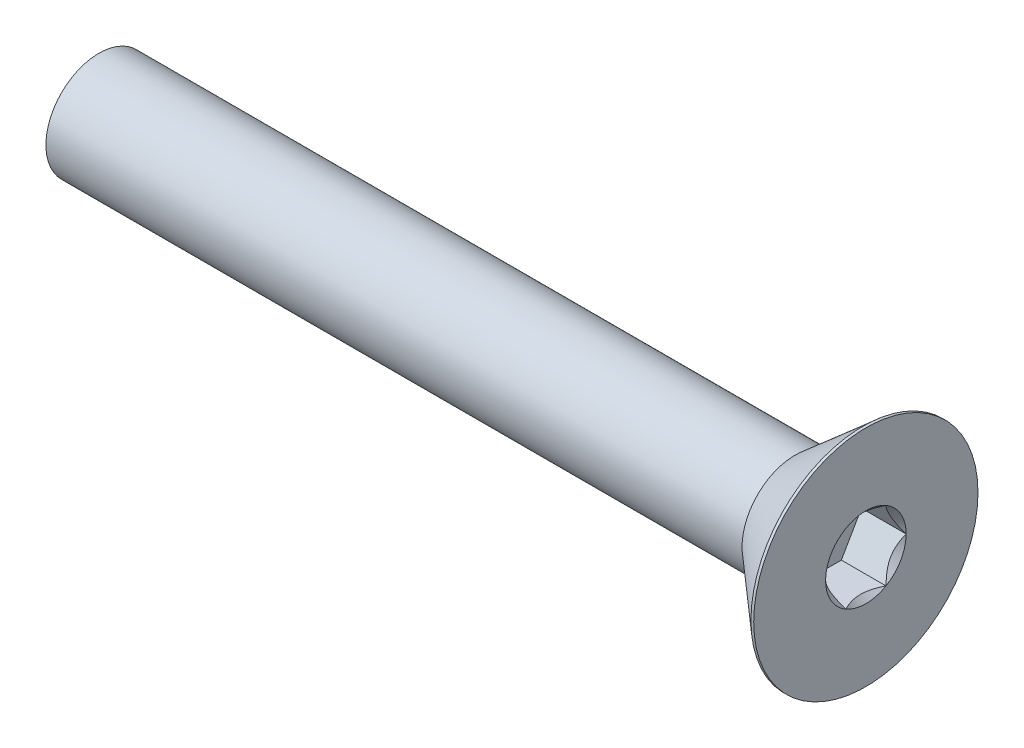
ISO-10303-21;
HEADER;
FILE_DESCRIPTION(('STEP AP214'),'2;1');
FILE_NAME('part.step','',(''),(''),'','','');
FILE_SCHEMA(('AUTOMOTIVE_DESIGN { 1 0 10303 214 1 1 1 1 }'));
ENDSEC;
DATA;
#1=APPLICATION_CONTEXT('core data for automotive mechanical design processes');
#2=APPLICATION_PROTOCOL_DEFINITION('international standard','automotive_design',2000,#1);
#3=PRODUCT_CONTEXT('',#1,'mechanical');
#4=PRODUCT('Part','Part','',(#3));
#5=PRODUCT_RELATED_PRODUCT_CATEGORY('part','',(#4));
#6=PRODUCT_DEFINITION_FORMATION('','',#4);
#7=PRODUCT_DEFINITION_CONTEXT('part definition',#1,'design');
#8=PRODUCT_DEFINITION('design','',#6,#7);
#9=PRODUCT_DEFINITION_SHAPE('','',#8);
#10=(LENGTH_UNIT() NAMED_UNIT(*) SI_UNIT(.MILLI.,.METRE.));
#11=(NAMED_UNIT(*) PLANE_ANGLE_UNIT() SI_UNIT($,.RADIAN.));
#12=(NAMED_UNIT(*) SI_UNIT($,.STERADIAN.) SOLID_ANGLE_UNIT());
#13=UNCERTAINTY_MEASURE_WITH_UNIT(LENGTH_MEASURE(1.E-05),#10,'distance_accuracy_value','');
#14=(GEOMETRIC_REPRESENTATION_CONTEXT(3) GLOBAL_UNCERTAINTY_ASSIGNED_CONTEXT((#13)) GLOBAL_UNIT_ASSIGNED_CONTEXT((#10,
#11,#12)) REPRESENTATION_CONTEXT('',''));
#15=CARTESIAN_POINT('',(0.,0.,0.));
#16=DIRECTION('',(0.,0.,1.));
#17=DIRECTION('',(1.,0.,0.));
#18=AXIS2_PLACEMENT_3D('',#15,#16,#17);
#19=CARTESIAN_POINT('',(1.193712867479,0.,0.));
#20=DIRECTION('',(1.,0.,0.));
#21=DIRECTION('',(0.,0.,-1.));
#22=AXIS2_PLACEMENT_3D('',#19,#20,#21);
#23=PLANE('',#22);
#24=DIRECTION('',(0.,-0.866025403784439,-0.5));
#25=VECTOR('',#24,1.);
#26=CARTESIAN_POINT('',(1.193712867479,-0.79375,1.3748153285078));
#27=LINE('',#26,#25);
#28=CARTESIAN_POINT('',(1.193712867479,0.,1.83308710467706));
#29=VERTEX_POINT('',#28);
#30=CARTESIAN_POINT('',(1.193712867479,-1.5875,0.916543552338532));
#31=VERTEX_POINT('',#30);
#32=EDGE_CURVE('E116',#29,#31,#27,.T.);
#33=ORIENTED_EDGE('',*,*,#32,.T.);
#34=DIRECTION('',(0.,0.,-1.));
#35=VECTOR('',#34,1.);
#36=CARTESIAN_POINT('',(1.193712867479,-1.5875,0.));
#37=LINE('',#36,#35);
#38=CARTESIAN_POINT('',(1.193712867479,-1.5875,-0.91654355233853));
#39=VERTEX_POINT('',#38);
#40=EDGE_CURVE('E83',#31,#39,#37,.T.);
#41=ORIENTED_EDGE('',*,*,#40,.T.);
#42=DIRECTION('',(0.,0.866025403784439,-0.5));
#43=VECTOR('',#42,1.);
#44=CARTESIAN_POINT('',(1.193712867479,-0.79375,-1.3748153285078));
#45=LINE('',#44,#43);
#46=CARTESIAN_POINT('',(1.193712867479,0.,-1.83308710467706));
#47=VERTEX_POINT('',#46);
#48=EDGE_CURVE('E85',#39,#47,#45,.T.);
#49=ORIENTED_EDGE('',*,*,#48,.T.);
#50=DIRECTION('',(0.,0.866025403784438,0.5));
#51=VECTOR('',#50,1.);
#52=CARTESIAN_POINT('',(1.193712867479,0.79375,-1.3748153285078));
#53=LINE('',#52,#51);
#54=CARTESIAN_POINT('',(1.193712867479,1.5875,-0.916543552338529));
#55=VERTEX_POINT('',#54);
#56=EDGE_CURVE('E86',#47,#55,#53,.T.);
#57=ORIENTED_EDGE('',*,*,#56,.T.);
#58=DIRECTION('',(0.,0.,1.));
#59=VECTOR('',#58,1.);
#60=CARTESIAN_POINT('',(1.193712867479,1.5875,0.));
#61=LINE('',#60,#59);
#62=CARTESIAN_POINT('',(1.193712867479,1.5875,0.916543552338531));
#63=VERTEX_POINT('',#62);
#64=EDGE_CURVE('E72',#55,#63,#61,.T.);
#65=ORIENTED_EDGE('',*,*,#64,.T.);
#66=DIRECTION('',(0.,-0.866025403784439,0.5));
#67=VECTOR('',#66,1.);
#68=CARTESIAN_POINT('',(1.193712867479,0.79375,1.3748153285078));
#69=LINE('',#68,#67);
#70=EDGE_CURVE('E111',#63,#29,#69,.T.);
#71=ORIENTED_EDGE('',*,*,#70,.T.);
#72=EDGE_LOOP('',(#33,#41,#49,#57,#65,#71));
#73=FACE_BOUND('',#72,.T.);
#74=ADVANCED_FACE('F17',(#73),#23,.T.);
#75=CARTESIAN_POINT('',(1.193712867479,0.79375,-1.3748153285078));
#76=DIRECTION('',(0.,0.5,-0.866025403784438));
#77=DIRECTION('',(0.,0.866025403784438,0.5));
#78=AXIS2_PLACEMENT_3D('',#75,#76,#77);
#79=PLANE('',#78);
#80=CARTESIAN_POINT('',(3.22571286749921,1.97744504712245E-11,-1.8330871046619));
#81=CARTESIAN_POINT('',(3.19424104985649,0.0545631502814841,-1.80158505517287));
#82=CARTESIAN_POINT('',(3.16461793027857,0.110038597590683,-1.76955629073647));
#83=CARTESIAN_POINT('',(3.11037926295271,0.223158727668802,-1.70424635318583));
#84=CARTESIAN_POINT('',(3.08579388372023,0.280814162289738,-1.67095897248692));
#85=CARTESIAN_POINT('',(3.04367896360977,0.397073518038479,-1.60383660214938));
#86=CARTESIAN_POINT('',(3.02604359703975,0.455647847373912,-1.57001869734003));
#87=CARTESIAN_POINT('',(2.99887295616823,0.574085662109062,-1.50163859312051));
#88=CARTESIAN_POINT('',(2.98931740761297,0.633945532003874,-1.46707848112307));
#89=CARTESIAN_POINT('',(2.98069560936954,0.737116774029563,-1.4075125367669));
#90=CARTESIAN_POINT('',(2.97941968925442,0.780294952190133,-1.38258360398278));
#91=CARTESIAN_POINT('',(2.98157200532214,0.866580665723893,-1.33276652404685));
#92=CARTESIAN_POINT('',(2.98500189035368,0.9096881710348,-1.3078783942515));
#93=CARTESIAN_POINT('',(2.99636918165326,0.995485199882861,-1.2583434565504));
#94=CARTESIAN_POINT('',(3.00431048767967,1.0381743292485,-1.23369687621968));
#95=CARTESIAN_POINT('',(3.02426914428919,1.12283605067337,-1.18481740856498));
#96=CARTESIAN_POINT('',(3.03628824374535,1.16480832716476,-1.16058470343417));
#97=CARTESIAN_POINT('',(3.07195669933733,1.27227527943182,-1.09853862961379));
#98=CARTESIAN_POINT('',(3.09829057499855,1.33710455598314,-1.06110942934552));
#99=CARTESIAN_POINT('',(3.14274348202929,1.432428884243,-1.00607390276437));
#100=CARTESIAN_POINT('',(3.15836122675381,1.4638412098837,-0.98793798809984));
#101=CARTESIAN_POINT('',(3.19102231804764,1.52608848239134,-0.951999508561233));
#102=CARTESIAN_POINT('',(3.20806498625861,1.55692369554143,-0.934196789948508));
#103=CARTESIAN_POINT('',(3.22571286749765,1.58749999997899,-0.916543552350657));
#104=B_SPLINE_CURVE_WITH_KNOTS('',3,(#80,#81,#82,#83,#84,#85,#86,#87,#88,#89,#90,#91,#92,#93,
#94,#95,#96,#97,#98,#99,#100,#101,#102,#103),.UNSPECIFIED.,.F.,.F.,(4,2,2,2,2,2,2,2,2,2,2,4),
(0.,0.21142792769077,0.42408719706539,0.63337015630011,0.842126401354033,0.991537200892027,
1.14100036526886,1.29059292547582,1.44024972380749,1.67781721397277,1.79627069398656,
1.91466809990155),.UNSPECIFIED.);
#105=CARTESIAN_POINT('',(3.22571286747856,0.,-1.83308710464583));
#106=VERTEX_POINT('',#105);
#107=CARTESIAN_POINT('',(3.22571286747256,1.58749999998961,-0.916543552282072));
#108=VERTEX_POINT('',#107);
#109=EDGE_CURVE('E20',#106,#108,#104,.T.);
#110=ORIENTED_EDGE('',*,*,#109,.T.);
#111=DIRECTION('',(1.,0.,0.));
#112=VECTOR('',#111,1.);
#113=CARTESIAN_POINT('',(1.193712867479,1.5875,-0.916543552338529));
#114=LINE('',#113,#112);
#115=EDGE_CURVE('E91',#108,#55,#114,.F.);
#116=ORIENTED_EDGE('',*,*,#115,.T.);
#117=ORIENTED_EDGE('',*,*,#56,.F.);
#118=DIRECTION('',(1.,0.,0.));
#119=VECTOR('',#118,1.);
#120=CARTESIAN_POINT('',(1.193712867479,0.,-1.83308710467706));
#121=LINE('',#120,#119);
#122=EDGE_CURVE('E59',#47,#106,#121,.T.);
#123=ORIENTED_EDGE('',*,*,#122,.T.);
#124=EDGE_LOOP('',(#110,#116,#117,#123));
#125=FACE_BOUND('',#124,.T.);
#126=ADVANCED_FACE('F90',(#125),#79,.F.);
#127=CARTESIAN_POINT('',(1.193712867479,-0.79375,-1.3748153285078));
#128=DIRECTION('',(0.,-0.5,-0.866025403784439));
#129=DIRECTION('',(0.,0.866025403784439,-0.5));
#130=AXIS2_PLACEMENT_3D('',#127,#128,#129);
#131=PLANE('',#130);
#132=CARTESIAN_POINT('',(3.22571286749921,-1.58749999997699,-0.916543552348075));
#133=CARTESIAN_POINT('',(3.19424104985649,-1.53293684971735,-0.948045601840705));
#134=CARTESIAN_POINT('',(3.16461793027856,-1.477461402409,-0.980074366278578));
#135=CARTESIAN_POINT('',(3.11037926295271,-1.36434127233151,-1.04538430383031));
#136=CARTESIAN_POINT('',(3.08579388372022,-1.30668583771035,-1.07867168452882));
#137=CARTESIAN_POINT('',(3.04367896360977,-1.19042648196144,-1.14579405486607));
#138=CARTESIAN_POINT('',(3.02604359703975,-1.13185215262607,-1.17961195967552));
#139=CARTESIAN_POINT('',(2.99887295616823,-1.01341433789096,-1.24799206389511));
#140=CARTESIAN_POINT('',(2.98931740761296,-0.953554467996131,-1.28255217589253));
#141=CARTESIAN_POINT('',(2.98069560936954,-0.850383225970434,-1.34211812024868));
#142=CARTESIAN_POINT('',(2.97941968925442,-0.807205047809867,-1.36704705303281));
#143=CARTESIAN_POINT('',(2.98157200532214,-0.720919334276108,-1.41686413296874));
#144=CARTESIAN_POINT('',(2.98500189035368,-0.677811828965201,-1.44175226276409));
#145=CARTESIAN_POINT('',(2.99636918165326,-0.592014800117139,-1.49128720046519));
#146=CARTESIAN_POINT('',(3.00431048767967,-0.549325670751498,-1.51593378079591));
#147=CARTESIAN_POINT('',(3.02426914428919,-0.464663949326633,-1.56481324845061));
#148=CARTESIAN_POINT('',(3.03628824374535,-0.422691672835241,-1.58904595358142));
#149=CARTESIAN_POINT('',(3.07195669933733,-0.315224720568184,-1.65109202740179));
#150=CARTESIAN_POINT('',(3.09829057499855,-0.250395444016862,-1.68852122767007));
#151=CARTESIAN_POINT('',(3.14274348202929,-0.155071115757,-1.74355675425122));
#152=CARTESIAN_POINT('',(3.15836122675381,-0.123658790116303,-1.76169266891575));
#153=CARTESIAN_POINT('',(3.19102231804764,-0.0614115176086629,-1.79763114845436));
#154=CARTESIAN_POINT('',(3.20806498625861,-0.030576304458571,-1.81543386706708));
#155=CARTESIAN_POINT('',(3.22571286749765,-2.1007314439158E-11,-1.83308710466493));
#156=B_SPLINE_CURVE_WITH_KNOTS('',3,(#132,#133,#134,#135,#136,#137,#138,#139,#140,#141,#142,
#143,#144,#145,#146,#147,#148,#149,#150,#151,#152,#153,#154,#155),.UNSPECIFIED.,.F.,.F.,(4,2,2,
2,2,2,2,2,2,2,2,4),(0.,0.21142792769077,0.424087197065389,0.63337015630011,0.842126401354032,
0.991537200892027,1.14100036526886,1.29059292547582,1.44024972380749,1.67781721397277,
1.79627069398655,1.91466809990155),.UNSPECIFIED.);
#157=CARTESIAN_POINT('',(3.22571286747855,-1.58749999997296,-0.916543552322916));
#158=VERTEX_POINT('',#157);
#159=EDGE_CURVE('E95',#158,#106,#156,.T.);
#160=ORIENTED_EDGE('',*,*,#159,.T.);
#161=ORIENTED_EDGE('',*,*,#122,.F.);
#162=ORIENTED_EDGE('',*,*,#48,.F.);
#163=DIRECTION('',(1.,0.,0.));
#164=VECTOR('',#163,1.);
#165=CARTESIAN_POINT('',(1.193712867479,-1.5875,-0.91654355233853));
#166=LINE('',#165,#164);
#167=EDGE_CURVE('E97',#39,#158,#166,.T.);
#168=ORIENTED_EDGE('',*,*,#167,.T.);
#169=EDGE_LOOP('',(#160,#161,#162,#168));
#170=FACE_BOUND('',#169,.T.);
#171=ADVANCED_FACE('F93',(#170),#131,.F.);
#172=CARTESIAN_POINT('',(1.193712867479,-1.5875,0.));
#173=DIRECTION('',(0.,-1.,0.));
#174=DIRECTION('',(0.,0.,-1.));
#175=AXIS2_PLACEMENT_3D('',#172,#173,#174);
#176=PLANE('',#175);
#177=CARTESIAN_POINT('',(3.22571286749921,-1.58749999999676,0.916543552313829));
#178=CARTESIAN_POINT('',(3.19424104985747,-1.58749999999883,0.853539453319641));
#179=CARTESIAN_POINT('',(3.16461793028103,-1.58749999999969,0.789481924432774));
#180=CARTESIAN_POINT('',(3.11037926295954,-1.58750000000031,0.658862049305218));
#181=CARTESIAN_POINT('',(3.08579388372993,-1.58750000000008,0.592287287895216));
#182=CARTESIAN_POINT('',(3.04367896362694,-1.58749999999992,0.458042547195921));
#183=CARTESIAN_POINT('',(3.02604359706144,-1.58749999999998,0.390406737565214));
#184=CARTESIAN_POINT('',(2.99887295620056,-1.58750000000002,0.253646529102881));
#185=CARTESIAN_POINT('',(2.9893174076514,-1.5875,0.184526305096713));
#186=CARTESIAN_POINT('',(2.98069560941883,-1.5875,0.0653944163581827));
#187=CARTESIAN_POINT('',(2.9794196893089,-1.5875,0.015536550774771));
#188=CARTESIAN_POINT('',(2.98157200538869,-1.5875,-0.0840976091268696));
#189=CARTESIAN_POINT('',(2.98500189042711,-1.5875,-0.133873868732162));
#190=CARTESIAN_POINT('',(2.99636918174166,-1.5875,-0.232943744162895));
#191=CARTESIAN_POINT('',(3.00431048777615,-1.5875,-0.282236904838276));
#192=CARTESIAN_POINT('',(3.02426914440257,-1.5875,-0.379995840174932));
#193=CARTESIAN_POINT('',(3.03628824386754,-1.5875,-0.428461250449861));
#194=CARTESIAN_POINT('',(3.07195669946032,-1.5875,-0.552553398046556));
#195=CARTESIAN_POINT('',(3.09829057510466,-1.5875,-0.627411798527956));
#196=CARTESIAN_POINT('',(3.14274348210133,-1.5875,-0.737482851611329));
#197=CARTESIAN_POINT('',(3.15836122681299,-1.5875,-0.773754680914626));
#198=CARTESIAN_POINT('',(3.19102231807881,-1.5875,-0.845631639941593));
#199=CARTESIAN_POINT('',(3.20806498627464,-1.5875,-0.881237077142556));
#200=CARTESIAN_POINT('',(3.22571286749765,-1.5875,-0.916543552314272));
#201=B_SPLINE_CURVE_WITH_KNOTS('',3,(#177,#178,#179,#180,#181,#182,#183,#184,#185,#186,#187,
#188,#189,#190,#191,#192,#193,#194,#195,#196,#197,#198,#199,#200),.UNSPECIFIED.,.F.,.F.,(4,2,2,
2,2,2,2,2,2,2,2,4),(0.,0.211427927723111,0.42408719713008,0.63337015639585,0.842126401480798,
0.991537201063777,1.14100036548566,1.29059292573772,1.44024972411449,1.67781721410847,
1.79627069403606,1.91466809986524),.UNSPECIFIED.);
#202=CARTESIAN_POINT('',(3.22571286747855,-1.58749999997296,0.916543552322919));
#203=VERTEX_POINT('',#202);
#204=EDGE_CURVE('E194',#203,#158,#201,.T.);
#205=ORIENTED_EDGE('',*,*,#204,.T.);
#206=ORIENTED_EDGE('',*,*,#167,.F.);
#207=ORIENTED_EDGE('',*,*,#40,.F.);
#208=DIRECTION('',(1.,0.,0.));
#209=VECTOR('',#208,1.);
#210=CARTESIAN_POINT('',(1.193712867479,-1.5875,0.916543552338532));
#211=LINE('',#210,#209);
#212=EDGE_CURVE('E113',#31,#203,#211,.T.);
#213=ORIENTED_EDGE('',*,*,#212,.T.);
#214=EDGE_LOOP('',(#205,#206,#207,#213));
#215=FACE_BOUND('',#214,.T.);
#216=ADVANCED_FACE('F204',(#215),#176,.F.);
#217=CARTESIAN_POINT('',(1.193712867479,-0.79375,1.3748153285078));
#218=DIRECTION('',(0.,-0.5,0.866025403784439));
#219=DIRECTION('',(0.,-0.866025403784439,-0.5));
#220=AXIS2_PLACEMENT_3D('',#217,#218,#219);
#221=PLANE('',#220);
#222=CARTESIAN_POINT('',(3.22571286749921,-1.97738121397812E-11,1.83308710466191));
#223=CARTESIAN_POINT('',(3.19424104985649,-0.0545631502814838,1.80158505517287));
#224=CARTESIAN_POINT('',(3.16461793027856,-0.110038597590683,1.76955629073647));
#225=CARTESIAN_POINT('',(3.11037926295271,-0.223158727668803,1.70424635318583));
#226=CARTESIAN_POINT('',(3.08579388372023,-0.280814162289738,1.67095897248692));
#227=CARTESIAN_POINT('',(3.04367896360977,-0.39707351803848,1.60383660214938));
#228=CARTESIAN_POINT('',(3.02604359703975,-0.455647847373913,1.57001869734004));
#229=CARTESIAN_POINT('',(2.99887295616823,-0.574085662109063,1.50163859312052));
#230=CARTESIAN_POINT('',(2.98931740761297,-0.633945532003875,1.46707848112307));
#231=CARTESIAN_POINT('',(2.98069560936954,-0.737116774029564,1.4075125367669));
#232=CARTESIAN_POINT('',(2.97941968925442,-0.780294952190134,1.38258360398278));
#233=CARTESIAN_POINT('',(2.98157200532214,-0.866580665723894,1.33276652404685));
#234=CARTESIAN_POINT('',(2.98500189035368,-0.909688171034801,1.3078783942515));
#235=CARTESIAN_POINT('',(2.99636918165326,-0.995485199882862,1.2583434565504));
#236=CARTESIAN_POINT('',(3.00431048767967,-1.0381743292485,1.23369687621968));
#237=CARTESIAN_POINT('',(3.02426914428919,-1.12283605067337,1.18481740856498));
#238=CARTESIAN_POINT('',(3.03628824374535,-1.16480832716476,1.16058470343417));
#239=CARTESIAN_POINT('',(3.07195669933733,-1.27227527943182,1.0985386296138));
#240=CARTESIAN_POINT('',(3.09829057499855,-1.33710455598314,1.06110942934552));
#241=CARTESIAN_POINT('',(3.14274348202929,-1.432428884243,1.00607390276437));
#242=CARTESIAN_POINT('',(3.15836122675381,-1.4638412098837,0.987937988099843));
#243=CARTESIAN_POINT('',(3.19102231804764,-1.52608848239134,0.951999508561237));
#244=CARTESIAN_POINT('',(3.20806498625861,-1.55692369554143,0.934196789948512));
#245=CARTESIAN_POINT('',(3.22571286749765,-1.58749999997899,0.916543552350661));
#246=B_SPLINE_CURVE_WITH_KNOTS('',3,(#222,#223,#224,#225,#226,#227,#228,#229,#230,#231,#232,
#233,#234,#235,#236,#237,#238,#239,#240,#241,#242,#243,#244,#245),.UNSPECIFIED.,.F.,.F.,(4,2,2,
2,2,2,2,2,2,2,2,4),(0.,0.211427927690771,0.424087197065391,0.633370156300111,0.842126401354034,
0.991537200892029,1.14100036526887,1.29059292547582,1.44024972380749,1.67781721397277,
1.79627069398655,1.91466809990154),.UNSPECIFIED.);
#247=CARTESIAN_POINT('',(3.22571286747855,0.,1.83308710464584));
#248=VERTEX_POINT('',#247);
#249=EDGE_CURVE('E186',#248,#203,#246,.T.);
#250=ORIENTED_EDGE('',*,*,#249,.T.);
#251=ORIENTED_EDGE('',*,*,#212,.F.);
#252=ORIENTED_EDGE('',*,*,#32,.F.);
#253=DIRECTION('',(1.,0.,0.));
#254=VECTOR('',#253,1.);
#255=CARTESIAN_POINT('',(1.193712867479,0.,1.83308710467706));
#256=LINE('',#255,#254);
#257=EDGE_CURVE('E108',#29,#248,#256,.T.);
#258=ORIENTED_EDGE('',*,*,#257,.T.);
#259=EDGE_LOOP('',(#250,#251,#252,#258));
#260=FACE_BOUND('',#259,.T.);
#261=ADVANCED_FACE('F200',(#260),#221,.F.);
#262=CARTESIAN_POINT('',(1.193712867479,0.79375,1.3748153285078));
#263=DIRECTION('',(0.,0.5,0.866025403784439));
#264=DIRECTION('',(0.,-0.866025403784439,0.5));
#265=AXIS2_PLACEMENT_3D('',#262,#263,#264);
#266=PLANE('',#265);
#267=CARTESIAN_POINT('',(3.22571286749921,1.58749999997699,0.916543552348078));
#268=CARTESIAN_POINT('',(3.19424104985649,1.53293684971735,0.948045601840708));
#269=CARTESIAN_POINT('',(3.16461793027856,1.477461402409,0.980074366278581));
#270=CARTESIAN_POINT('',(3.11037926295271,1.36434127233151,1.04538430383031));
#271=CARTESIAN_POINT('',(3.08579388372023,1.30668583771035,1.07867168452882));
#272=CARTESIAN_POINT('',(3.04367896360977,1.19042648196144,1.14579405486607));
#273=CARTESIAN_POINT('',(3.02604359703975,1.13185215262607,1.17961195967552));
#274=CARTESIAN_POINT('',(2.99887295616823,1.01341433789096,1.24799206389512));
#275=CARTESIAN_POINT('',(2.98931740761297,0.953554467996131,1.28255217589253));
#276=CARTESIAN_POINT('',(2.98069560936954,0.850383225970434,1.34211812024869));
#277=CARTESIAN_POINT('',(2.97941968925442,0.807205047809866,1.36704705303281));
#278=CARTESIAN_POINT('',(2.98157200532214,0.720919334276108,1.41686413296875));
#279=CARTESIAN_POINT('',(2.98500189035368,0.6778118289652,1.44175226276409));
#280=CARTESIAN_POINT('',(2.99636918165326,0.592014800117139,1.49128720046519));
#281=CARTESIAN_POINT('',(3.00431048767967,0.549325670751497,1.51593378079591));
#282=CARTESIAN_POINT('',(3.02426914428919,0.464663949326632,1.56481324845062));
#283=CARTESIAN_POINT('',(3.03628824374535,0.42269167283524,1.58904595358142));
#284=CARTESIAN_POINT('',(3.07195669933733,0.315224720568184,1.6510920274018));
#285=CARTESIAN_POINT('',(3.09829057499855,0.250395444016862,1.68852122767007));
#286=CARTESIAN_POINT('',(3.14274348202929,0.155071115757,1.74355675425122));
#287=CARTESIAN_POINT('',(3.15836122675381,0.123658790116303,1.76169266891575));
#288=CARTESIAN_POINT('',(3.19102231804764,0.0614115176086636,1.79763114845436));
#289=CARTESIAN_POINT('',(3.20806498625861,0.0305763044585719,1.81543386706708));
#290=CARTESIAN_POINT('',(3.22571286749765,2.10084324813225E-11,1.83308710466493));
#291=B_SPLINE_CURVE_WITH_KNOTS('',3,(#267,#268,#269,#270,#271,#272,#273,#274,#275,#276,#277,
#278,#279,#280,#281,#282,#283,#284,#285,#286,#287,#288,#289,#290),.UNSPECIFIED.,.F.,.F.,(4,2,2,
2,2,2,2,2,2,2,2,4),(0.,0.21142792769077,0.42408719706539,0.633370156300109,0.842126401354033,
0.991537200892027,1.14100036526886,1.29059292547582,1.44024972380749,1.67781721397277,
1.79627069398655,1.91466809990154),.UNSPECIFIED.);
#292=CARTESIAN_POINT('',(3.22571286747855,1.58749999997296,0.916543552322918));
#293=VERTEX_POINT('',#292);
#294=EDGE_CURVE('E156',#293,#248,#291,.T.);
#295=ORIENTED_EDGE('',*,*,#294,.T.);
#296=ORIENTED_EDGE('',*,*,#257,.F.);
#297=ORIENTED_EDGE('',*,*,#70,.F.);
#298=DIRECTION('',(1.,0.,0.));
#299=VECTOR('',#298,1.);
#300=CARTESIAN_POINT('',(1.193712867479,1.5875,0.916543552338531));
#301=LINE('',#300,#299);
#302=EDGE_CURVE('E40',#63,#293,#301,.T.);
#303=ORIENTED_EDGE('',*,*,#302,.T.);
#304=EDGE_LOOP('',(#295,#296,#297,#303));
#305=FACE_BOUND('',#304,.T.);
#306=ADVANCED_FACE('F203',(#305),#266,.F.);
#307=CARTESIAN_POINT('',(1.193712867479,1.5875,0.));
#308=DIRECTION('',(0.,1.,0.));
#309=DIRECTION('',(0.,0.,1.));
#310=AXIS2_PLACEMENT_3D('',#307,#308,#309);
#311=PLANE('',#310);
#312=CARTESIAN_POINT('',(3.22571286749921,1.58749999999676,-0.916543552313825));
#313=CARTESIAN_POINT('',(3.19424104985649,1.58749999999884,-0.853539453332158));
#314=CARTESIAN_POINT('',(3.16461793027856,1.58749999999969,-0.789481924457888));
#315=CARTESIAN_POINT('',(3.11037926295271,1.58750000000031,-0.658862049355516));
#316=CARTESIAN_POINT('',(3.08579388372023,1.58750000000008,-0.592287287958098));
#317=CARTESIAN_POINT('',(3.04367896360977,1.58749999999992,-0.458042547283306));
#318=CARTESIAN_POINT('',(3.02604359703975,1.58749999999998,-0.390406737664513));
#319=CARTESIAN_POINT('',(2.99887295616823,1.58750000000002,-0.253646529225399));
#320=CARTESIAN_POINT('',(2.98931740761297,1.58750000000001,-0.184526305230538));
#321=CARTESIAN_POINT('',(2.98069560936954,1.5875,-0.065394416518214));
#322=CARTESIAN_POINT('',(2.97941968925442,1.5875,-0.0155365509499703));
#323=CARTESIAN_POINT('',(2.98157200532214,1.5875,0.0840976089218999));
#324=CARTESIAN_POINT('',(2.98500189035368,1.5875,0.133873868512591));
#325=CARTESIAN_POINT('',(2.99636918165327,1.5875,0.232943743914787));
#326=CARTESIAN_POINT('',(3.00431048767967,1.5875,0.282236904576235));
#327=CARTESIAN_POINT('',(3.02426914428919,1.5875,0.379995839885641));
#328=CARTESIAN_POINT('',(3.03628824374535,1.5875,0.428461250147255));
#329=CARTESIAN_POINT('',(3.07195669933733,1.5875,0.552553397788002));
#330=CARTESIAN_POINT('',(3.09829057499855,1.5875,0.627411798324551));
#331=CARTESIAN_POINT('',(3.14274348202929,1.5875,0.737482851486853));
#332=CARTESIAN_POINT('',(3.15836122675381,1.5875,0.77375468081591));
#333=CARTESIAN_POINT('',(3.19102231804764,1.5875,0.845631639893122));
#334=CARTESIAN_POINT('',(3.20806498625861,1.5875,0.881237077118572));
#335=CARTESIAN_POINT('',(3.22571286749765,1.5875,0.916543552314274));
#336=B_SPLINE_CURVE_WITH_KNOTS('',3,(#312,#313,#314,#315,#316,#317,#318,#319,#320,#321,#322,
#323,#324,#325,#326,#327,#328,#329,#330,#331,#332,#333,#334,#335),.UNSPECIFIED.,.F.,.F.,(4,2,2,
2,2,2,2,2,2,2,2,4),(0.,0.21142792769077,0.424087197065389,0.633370156300109,0.842126401354031,
0.991537200892026,1.14100036526886,1.29059292547582,1.44024972380749,1.67781721397277,
1.79627069398655,1.91466809990154),.UNSPECIFIED.);
#337=EDGE_CURVE('E148',#108,#293,#336,.T.);
#338=ORIENTED_EDGE('',*,*,#337,.T.);
#339=ORIENTED_EDGE('',*,*,#302,.F.);
#340=ORIENTED_EDGE('',*,*,#64,.F.);
#341=ORIENTED_EDGE('',*,*,#115,.F.);
#342=EDGE_LOOP('',(#338,#339,#340,#341));
#343=FACE_BOUND('',#342,.T.);
#344=ADVANCED_FACE('F164',(#343),#311,.F.);
#345=CARTESIAN_POINT('',(3.22571286739048,0.,0.));
#346=DIRECTION('',(1.,0.,0.));
#347=DIRECTION('',(0.,0.,-1.));
#348=AXIS2_PLACEMENT_3D('',#345,#346,#347);
#349=CONICAL_SURFACE('',#348,1.83308710455776,0.785398163397448);
#350=ORIENTED_EDGE('',*,*,#109,.F.);
#351=CARTESIAN_POINT('',(3.22571286744733,0.,0.));
#352=DIRECTION('',(1.,0.,0.));
#353=DIRECTION('',(0.,0.,-1.));
#354=AXIS2_PLACEMENT_3D('',#351,#352,#353);
#355=CIRCLE('',#354,1.83308710461461);
#356=EDGE_CURVE('E145',#108,#106,#355,.F.);
#357=ORIENTED_EDGE('',*,*,#356,.F.);
#358=EDGE_LOOP('',(#350,#357));
#359=FACE_BOUND('',#358,.T.);
#360=ADVANCED_FACE('F221',(#359),#349,.F.);
#361=CARTESIAN_POINT('',(3.22571286739048,0.,0.));
#362=DIRECTION('',(1.,0.,0.));
#363=DIRECTION('',(0.,0.,-1.));
#364=AXIS2_PLACEMENT_3D('',#361,#362,#363);
#365=CONICAL_SURFACE('',#364,1.83308710455776,0.785398163397448);
#366=ORIENTED_EDGE('',*,*,#159,.F.);
#367=CARTESIAN_POINT('',(3.22571286744733,0.,0.));
#368=DIRECTION('',(1.,0.,0.));
#369=DIRECTION('',(0.,0.,-1.));
#370=AXIS2_PLACEMENT_3D('',#367,#368,#369);
#371=CIRCLE('',#370,1.83308710461461);
#372=EDGE_CURVE('E142',#106,#158,#371,.F.);
#373=ORIENTED_EDGE('',*,*,#372,.F.);
#374=EDGE_LOOP('',(#366,#373));
#375=FACE_BOUND('',#374,.T.);
#376=ADVANCED_FACE('F218',(#375),#365,.F.);
#377=CARTESIAN_POINT('',(3.22571286739048,0.,0.));
#378=DIRECTION('',(1.,0.,0.));
#379=DIRECTION('',(0.,0.,-1.));
#380=AXIS2_PLACEMENT_3D('',#377,#378,#379);
#381=CONICAL_SURFACE('',#380,1.83308710455776,0.785398163512482);
#382=ORIENTED_EDGE('',*,*,#204,.F.);
#383=CARTESIAN_POINT('',(3.22571286744733,0.,0.));
#384=DIRECTION('',(1.,0.,0.));
#385=DIRECTION('',(0.,0.,-1.));
#386=AXIS2_PLACEMENT_3D('',#383,#384,#385);
#387=CIRCLE('',#386,1.83308710461461);
#388=EDGE_CURVE('E139',#158,#203,#387,.F.);
#389=ORIENTED_EDGE('',*,*,#388,.F.);
#390=EDGE_LOOP('',(#382,#389));
#391=FACE_BOUND('',#390,.T.);
#392=ADVANCED_FACE('F182',(#391),#381,.F.);
#393=CARTESIAN_POINT('',(3.22571286739048,0.,0.));
#394=DIRECTION('',(1.,0.,0.));
#395=DIRECTION('',(0.,0.,-1.));
#396=AXIS2_PLACEMENT_3D('',#393,#394,#395);
#397=CONICAL_SURFACE('',#396,1.83308710455776,0.785398163397448);
#398=ORIENTED_EDGE('',*,*,#249,.F.);
#399=CARTESIAN_POINT('',(3.22571286744733,0.,0.));
#400=DIRECTION('',(1.,0.,0.));
#401=DIRECTION('',(0.,0.,-1.));
#402=AXIS2_PLACEMENT_3D('',#399,#400,#401);
#403=CIRCLE('',#402,1.83308710461461);
#404=EDGE_CURVE('E136',#203,#248,#403,.F.);
#405=ORIENTED_EDGE('',*,*,#404,.F.);
#406=EDGE_LOOP('',(#398,#405));
#407=FACE_BOUND('',#406,.T.);
#408=ADVANCED_FACE('F177',(#407),#397,.F.);
#409=CARTESIAN_POINT('',(3.22571286739048,0.,0.));
#410=DIRECTION('',(1.,0.,0.));
#411=DIRECTION('',(0.,0.,-1.));
#412=AXIS2_PLACEMENT_3D('',#409,#410,#411);
#413=CONICAL_SURFACE('',#412,1.83308710455776,0.785398163397448);
#414=ORIENTED_EDGE('',*,*,#294,.F.);
#415=CARTESIAN_POINT('',(3.22571286744733,0.,0.));
#416=DIRECTION('',(1.,0.,0.));
#417=DIRECTION('',(0.,0.,-1.));
#418=AXIS2_PLACEMENT_3D('',#415,#416,#417);
#419=CIRCLE('',#418,1.83308710461461);
#420=EDGE_CURVE('E133',#248,#293,#419,.F.);
#421=ORIENTED_EDGE('',*,*,#420,.F.);
#422=EDGE_LOOP('',(#414,#421));
#423=FACE_BOUND('',#422,.T.);
#424=ADVANCED_FACE('F171',(#423),#413,.F.);
#425=CARTESIAN_POINT('',(3.22571286739048,0.,0.));
#426=DIRECTION('',(1.,0.,0.));
#427=DIRECTION('',(0.,0.,-1.));
#428=AXIS2_PLACEMENT_3D('',#425,#426,#427);
#429=CONICAL_SURFACE('',#428,1.83308710455776,0.785398163397448);
#430=ORIENTED_EDGE('',*,*,#337,.F.);
#431=CARTESIAN_POINT('',(3.22571286744733,0.,0.));
#432=DIRECTION('',(1.,0.,0.));
#433=DIRECTION('',(0.,0.,-1.));
#434=AXIS2_PLACEMENT_3D('',#431,#432,#433);
#435=CIRCLE('',#434,1.83308710461461);
#436=EDGE_CURVE('E130',#293,#108,#435,.F.);
#437=ORIENTED_EDGE('',*,*,#436,.F.);
#438=EDGE_LOOP('',(#430,#437));
#439=FACE_BOUND('',#438,.T.);
#440=ADVANCED_FACE('F166',(#439),#429,.F.);
#441=CARTESIAN_POINT('',(3.225712867479,0.,-5.10667));
#442=DIRECTION('',(1.,0.,0.));
#443=DIRECTION('',(0.,0.,-1.));
#444=AXIS2_PLACEMENT_3D('',#441,#442,#443);
#445=PLANE('',#444);
#446=CARTESIAN_POINT('',(3.225712867479,0.,0.));
#447=DIRECTION('',(1.,0.,0.));
#448=DIRECTION('',(0.,0.,-1.));
#449=AXIS2_PLACEMENT_3D('',#446,#447,#448);
#450=CIRCLE('',#449,5.10667);
#451=CARTESIAN_POINT('',(3.225712867479,0.,-5.10667));
#452=VERTEX_POINT('',#451);
#453=EDGE_CURVE('E127',#452,#452,#450,.F.);
#454=ORIENTED_EDGE('',*,*,#453,.F.);
#455=EDGE_LOOP('',(#454));
#456=FACE_BOUND('',#455,.T.);
#457=ORIENTED_EDGE('',*,*,#420,.T.);
#458=ORIENTED_EDGE('',*,*,#436,.T.);
#459=ORIENTED_EDGE('',*,*,#356,.T.);
#460=ORIENTED_EDGE('',*,*,#372,.T.);
#461=ORIENTED_EDGE('',*,*,#388,.T.);
#462=ORIENTED_EDGE('',*,*,#404,.T.);
#463=EDGE_LOOP('',(#457,#458,#459,#460,#461,#462));
#464=FACE_BOUND('',#463,.T.);
#465=ADVANCED_FACE('F170',(#456,#464),#445,.T.);
#466=CARTESIAN_POINT('',(3.225712867479,0.,0.));
#467=DIRECTION('',(1.,0.,0.));
#468=DIRECTION('',(0.,0.,-1.));
#469=AXIS2_PLACEMENT_3D('',#466,#467,#468);
#470=CYLINDRICAL_SURFACE('',#469,5.10667);
#471=ORIENTED_EDGE('',*,*,#453,.T.);
#472=EDGE_LOOP('',(#471));
#473=FACE_BOUND('',#472,.T.);
#474=CARTESIAN_POINT('',(3.09871286748375,0.,0.));
#475=DIRECTION('',(1.,0.,0.));
#476=DIRECTION('',(0.,0.,-1.));
#477=AXIS2_PLACEMENT_3D('',#474,#475,#476);
#478=CIRCLE('',#477,5.10666999997511);
#479=CARTESIAN_POINT('',(3.09871286748375,0.,-5.10666999997511));
#480=VERTEX_POINT('',#479);
#481=EDGE_CURVE('E126',#480,#480,#478,.F.);
#482=ORIENTED_EDGE('',*,*,#481,.F.);
#483=EDGE_LOOP('',(#482));
#484=FACE_BOUND('',#483,.T.);
#485=ADVANCED_FACE('F245',(#473,#484),#470,.T.);
#486=CARTESIAN_POINT('',(-31.6992,0.,0.));
#487=DIRECTION('',(-1.,0.,0.));
#488=DIRECTION('',(0.,0.,1.));
#489=AXIS2_PLACEMENT_3D('',#486,#487,#488);
#490=PLANE('',#489);
#491=CARTESIAN_POINT('',(-31.6992,0.,0.));
#492=DIRECTION('',(1.,0.,0.));
#493=DIRECTION('',(0.,0.,-1.));
#494=AXIS2_PLACEMENT_3D('',#491,#492,#493);
#495=CIRCLE('',#494,2.413);
#496=CARTESIAN_POINT('',(-31.6992,0.,-2.41300000000001));
#497=VERTEX_POINT('',#496);
#498=EDGE_CURVE('E31',#497,#497,#495,.T.);
#499=ORIENTED_EDGE('',*,*,#498,.F.);
#500=EDGE_LOOP('',(#499));
#501=FACE_BOUND('',#500,.T.);
#502=ADVANCED_FACE('F239',(#501),#490,.T.);
#503=CARTESIAN_POINT('',(3.09871286731322,0.,0.));
#504=DIRECTION('',(1.,0.,0.));
#505=DIRECTION('',(0.,0.,-1.));
#506=AXIS2_PLACEMENT_3D('',#503,#504,#505);
#507=CONICAL_SURFACE('',#506,5.10666999980458,0.71558499331418);
#508=ORIENTED_EDGE('',*,*,#481,.T.);
#509=EDGE_LOOP('',(#508));
#510=FACE_BOUND('',#509,.T.);
#511=CARTESIAN_POINT('',(0.,0.,0.));
#512=DIRECTION('',(1.,0.,0.));
#513=DIRECTION('',(0.,0.,-1.));
#514=AXIS2_PLACEMENT_3D('',#511,#512,#513);
#515=CIRCLE('',#514,2.413);
#516=CARTESIAN_POINT('',(0.,0.,-2.413));
#517=VERTEX_POINT('',#516);
#518=EDGE_CURVE('E11',#517,#517,#515,.F.);
#519=ORIENTED_EDGE('',*,*,#518,.F.);
#520=EDGE_LOOP('',(#519));
#521=FACE_BOUND('',#520,.T.);
#522=ADVANCED_FACE('F233',(#510,#521),#507,.T.);
#523=CARTESIAN_POINT('',(-31.6992,0.,0.));
#524=DIRECTION('',(1.,0.,0.));
#525=DIRECTION('',(0.,0.,-1.));
#526=AXIS2_PLACEMENT_3D('',#523,#524,#525);
#527=CYLINDRICAL_SURFACE('',#526,2.413);
#528=ORIENTED_EDGE('',*,*,#518,.T.);
#529=EDGE_LOOP('',(#528));
#530=FACE_BOUND('',#529,.T.);
#531=ORIENTED_EDGE('',*,*,#498,.T.);
#532=EDGE_LOOP('',(#531));
#533=FACE_BOUND('',#532,.T.);
#534=ADVANCED_FACE('F231',(#530,#533),#527,.T.);
#535=CLOSED_SHELL('',(#74,#126,#171,#216,#261,#306,#344,#360,#376,#392,#408,#424,#440,#465,#485,
#502,#522,#534));
#536=MANIFOLD_SOLID_BREP('B1',#535);
#537=ADVANCED_BREP_SHAPE_REPRESENTATION('',(#18,#536),#14);
#538=SHAPE_DEFINITION_REPRESENTATION(#9,#537);
ENDSEC;
END-ISO-10303-21;
